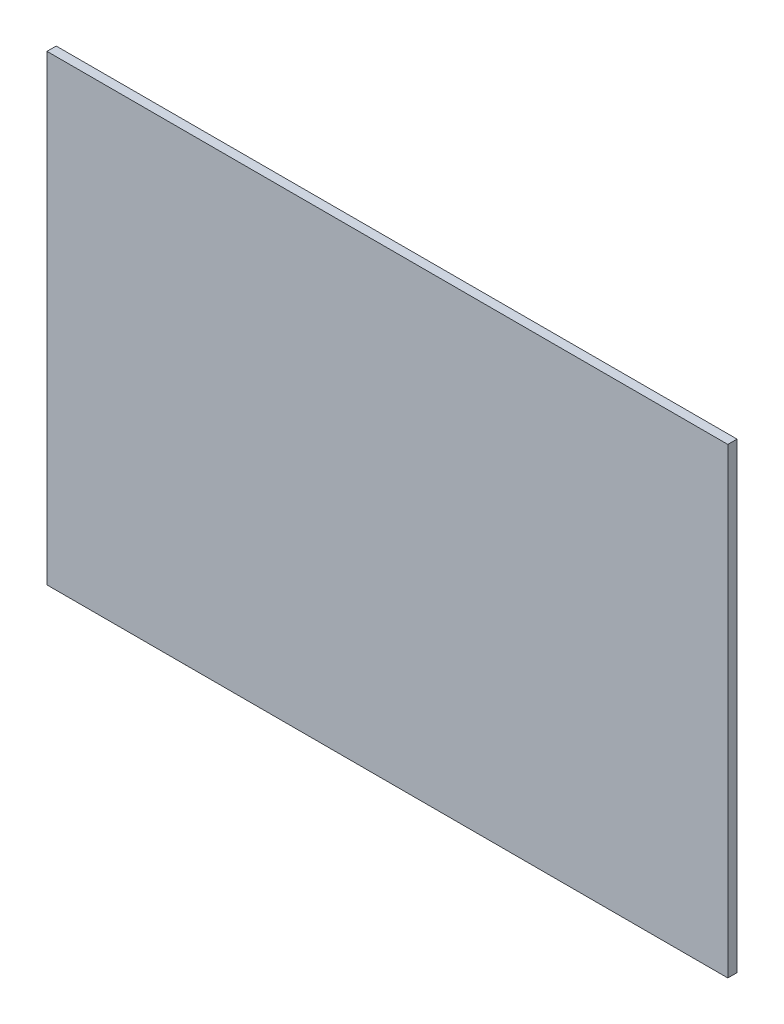
ISO-10303-21;
HEADER;
FILE_DESCRIPTION(('STEP AP214'),'2;1');
FILE_NAME('part.step','',(''),(''),'','','');
FILE_SCHEMA(('AUTOMOTIVE_DESIGN { 1 0 10303 214 1 1 1 1 }'));
ENDSEC;
DATA;
#1=APPLICATION_CONTEXT('core data for automotive mechanical design processes');
#2=APPLICATION_PROTOCOL_DEFINITION('international standard','automotive_design',2000,#1);
#3=PRODUCT_CONTEXT('',#1,'mechanical');
#4=PRODUCT('Part','Part','',(#3));
#5=PRODUCT_RELATED_PRODUCT_CATEGORY('part','',(#4));
#6=PRODUCT_DEFINITION_FORMATION('','',#4);
#7=PRODUCT_DEFINITION_CONTEXT('part definition',#1,'design');
#8=PRODUCT_DEFINITION('design','',#6,#7);
#9=PRODUCT_DEFINITION_SHAPE('','',#8);
#10=(LENGTH_UNIT() NAMED_UNIT(*) SI_UNIT(.MILLI.,.METRE.));
#11=(NAMED_UNIT(*) PLANE_ANGLE_UNIT() SI_UNIT($,.RADIAN.));
#12=(NAMED_UNIT(*) SI_UNIT($,.STERADIAN.) SOLID_ANGLE_UNIT());
#13=UNCERTAINTY_MEASURE_WITH_UNIT(LENGTH_MEASURE(1.E-05),#10,'distance_accuracy_value','');
#14=(GEOMETRIC_REPRESENTATION_CONTEXT(3) GLOBAL_UNCERTAINTY_ASSIGNED_CONTEXT((#13)) GLOBAL_UNIT_ASSIGNED_CONTEXT((#10,
#11,#12)) REPRESENTATION_CONTEXT('',''));
#15=CARTESIAN_POINT('',(0.,0.,0.));
#16=DIRECTION('',(0.,0.,1.));
#17=DIRECTION('',(1.,0.,0.));
#18=AXIS2_PLACEMENT_3D('',#15,#16,#17);
#19=CARTESIAN_POINT('',(0.,0.,1.51892));
#20=DIRECTION('',(1.,0.,0.));
#21=DIRECTION('',(0.,0.,-1.));
#22=AXIS2_PLACEMENT_3D('',#19,#20,#21);
#23=PLANE('',#22);
#24=DIRECTION('',(0.,-1.,0.));
#25=VECTOR('',#24,1.);
#26=CARTESIAN_POINT('',(0.,0.,0.));
#27=LINE('',#26,#25);
#28=CARTESIAN_POINT('',(0.,76.2,0.));
#29=VERTEX_POINT('',#28);
#30=CARTESIAN_POINT('',(0.,0.,0.));
#31=VERTEX_POINT('',#30);
#32=EDGE_CURVE('E107',#29,#31,#27,.T.);
#33=ORIENTED_EDGE('',*,*,#32,.T.);
#34=DIRECTION('',(0.,0.,-1.));
#35=VECTOR('',#34,1.);
#36=CARTESIAN_POINT('',(0.,0.,1.51892));
#37=LINE('',#36,#35);
#38=CARTESIAN_POINT('',(0.,0.,1.51892));
#39=VERTEX_POINT('',#38);
#40=EDGE_CURVE('E11',#39,#31,#37,.T.);
#41=ORIENTED_EDGE('',*,*,#40,.F.);
#42=DIRECTION('',(0.,-1.,0.));
#43=VECTOR('',#42,1.);
#44=CARTESIAN_POINT('',(0.,0.,1.51892));
#45=LINE('',#44,#43);
#46=CARTESIAN_POINT('',(0.,76.2,1.51892));
#47=VERTEX_POINT('',#46);
#48=EDGE_CURVE('E91',#47,#39,#45,.T.);
#49=ORIENTED_EDGE('',*,*,#48,.F.);
#50=DIRECTION('',(0.,0.,-1.));
#51=VECTOR('',#50,1.);
#52=CARTESIAN_POINT('',(0.,76.2,1.51892));
#53=LINE('',#52,#51);
#54=EDGE_CURVE('E103',#47,#29,#53,.T.);
#55=ORIENTED_EDGE('',*,*,#54,.T.);
#56=EDGE_LOOP('',(#33,#41,#49,#55));
#57=FACE_BOUND('',#56,.T.);
#58=ADVANCED_FACE('F39',(#57),#23,.F.);
#59=CARTESIAN_POINT('',(0.,0.,1.51892));
#60=DIRECTION('',(0.,1.,0.));
#61=DIRECTION('',(0.,0.,1.));
#62=AXIS2_PLACEMENT_3D('',#59,#60,#61);
#63=PLANE('',#62);
#64=DIRECTION('',(1.,0.,0.));
#65=VECTOR('',#64,1.);
#66=CARTESIAN_POINT('',(0.,0.,0.));
#67=LINE('',#66,#65);
#68=CARTESIAN_POINT('',(112.268,0.,0.));
#69=VERTEX_POINT('',#68);
#70=EDGE_CURVE('E96',#31,#69,#67,.T.);
#71=ORIENTED_EDGE('',*,*,#70,.T.);
#72=DIRECTION('',(0.,0.,-1.));
#73=VECTOR('',#72,1.);
#74=CARTESIAN_POINT('',(112.268,0.,1.51892));
#75=LINE('',#74,#73);
#76=CARTESIAN_POINT('',(112.268,0.,1.51892));
#77=VERTEX_POINT('',#76);
#78=EDGE_CURVE('E48',#77,#69,#75,.T.);
#79=ORIENTED_EDGE('',*,*,#78,.F.);
#80=DIRECTION('',(1.,0.,0.));
#81=VECTOR('',#80,1.);
#82=CARTESIAN_POINT('',(0.,0.,1.51892));
#83=LINE('',#82,#81);
#84=EDGE_CURVE('E86',#39,#77,#83,.T.);
#85=ORIENTED_EDGE('',*,*,#84,.F.);
#86=ORIENTED_EDGE('',*,*,#40,.T.);
#87=EDGE_LOOP('',(#71,#79,#85,#86));
#88=FACE_BOUND('',#87,.T.);
#89=ADVANCED_FACE('F95',(#88),#63,.F.);
#90=CARTESIAN_POINT('',(112.268,0.,1.51892));
#91=DIRECTION('',(-1.,0.,0.));
#92=DIRECTION('',(0.,0.,1.));
#93=AXIS2_PLACEMENT_3D('',#90,#91,#92);
#94=PLANE('',#93);
#95=DIRECTION('',(0.,1.,0.));
#96=VECTOR('',#95,1.);
#97=CARTESIAN_POINT('',(112.268,0.,0.));
#98=LINE('',#97,#96);
#99=CARTESIAN_POINT('',(112.268,76.2,0.));
#100=VERTEX_POINT('',#99);
#101=EDGE_CURVE('E73',#69,#100,#98,.T.);
#102=ORIENTED_EDGE('',*,*,#101,.T.);
#103=DIRECTION('',(0.,0.,-1.));
#104=VECTOR('',#103,1.);
#105=CARTESIAN_POINT('',(112.268,76.2,1.51892));
#106=LINE('',#105,#104);
#107=CARTESIAN_POINT('',(112.268,76.2,1.51892));
#108=VERTEX_POINT('',#107);
#109=EDGE_CURVE('E98',#108,#100,#106,.T.);
#110=ORIENTED_EDGE('',*,*,#109,.F.);
#111=DIRECTION('',(0.,1.,0.));
#112=VECTOR('',#111,1.);
#113=CARTESIAN_POINT('',(112.268,0.,1.51892));
#114=LINE('',#113,#112);
#115=EDGE_CURVE('E89',#77,#108,#114,.T.);
#116=ORIENTED_EDGE('',*,*,#115,.F.);
#117=ORIENTED_EDGE('',*,*,#78,.T.);
#118=EDGE_LOOP('',(#102,#110,#116,#117));
#119=FACE_BOUND('',#118,.T.);
#120=ADVANCED_FACE('F99',(#119),#94,.F.);
#121=CARTESIAN_POINT('',(0.,76.2,1.51892));
#122=DIRECTION('',(0.,-1.,0.));
#123=DIRECTION('',(0.,0.,-1.));
#124=AXIS2_PLACEMENT_3D('',#121,#122,#123);
#125=PLANE('',#124);
#126=DIRECTION('',(-1.,0.,0.));
#127=VECTOR('',#126,1.);
#128=CARTESIAN_POINT('',(0.,76.2,0.));
#129=LINE('',#128,#127);
#130=EDGE_CURVE('E79',#100,#29,#129,.T.);
#131=ORIENTED_EDGE('',*,*,#130,.T.);
#132=ORIENTED_EDGE('',*,*,#54,.F.);
#133=DIRECTION('',(-1.,0.,0.));
#134=VECTOR('',#133,1.);
#135=CARTESIAN_POINT('',(0.,76.2,1.51892));
#136=LINE('',#135,#134);
#137=EDGE_CURVE('E56',#108,#47,#136,.T.);
#138=ORIENTED_EDGE('',*,*,#137,.F.);
#139=ORIENTED_EDGE('',*,*,#109,.T.);
#140=EDGE_LOOP('',(#131,#132,#138,#139));
#141=FACE_BOUND('',#140,.T.);
#142=ADVANCED_FACE('F120',(#141),#125,.F.);
#143=CARTESIAN_POINT('',(0.,0.,1.51892));
#144=DIRECTION('',(0.,0.,-1.));
#145=DIRECTION('',(-1.,0.,0.));
#146=AXIS2_PLACEMENT_3D('',#143,#144,#145);
#147=PLANE('',#146);
#148=ORIENTED_EDGE('',*,*,#48,.T.);
#149=ORIENTED_EDGE('',*,*,#84,.T.);
#150=ORIENTED_EDGE('',*,*,#115,.T.);
#151=ORIENTED_EDGE('',*,*,#137,.T.);
#152=EDGE_LOOP('',(#148,#149,#150,#151));
#153=FACE_BOUND('',#152,.T.);
#154=ADVANCED_FACE('F87',(#153),#147,.F.);
#155=CARTESIAN_POINT('',(0.,0.,0.));
#156=DIRECTION('',(0.,0.,-1.));
#157=DIRECTION('',(-1.,0.,0.));
#158=AXIS2_PLACEMENT_3D('',#155,#156,#157);
#159=PLANE('',#158);
#160=ORIENTED_EDGE('',*,*,#32,.F.);
#161=ORIENTED_EDGE('',*,*,#130,.F.);
#162=ORIENTED_EDGE('',*,*,#101,.F.);
#163=ORIENTED_EDGE('',*,*,#70,.F.);
#164=EDGE_LOOP('',(#160,#161,#162,#163));
#165=FACE_BOUND('',#164,.T.);
#166=ADVANCED_FACE('F123',(#165),#159,.T.);
#167=CLOSED_SHELL('',(#58,#89,#120,#142,#154,#166));
#168=MANIFOLD_SOLID_BREP('B2',#167);
#169=ADVANCED_BREP_SHAPE_REPRESENTATION('',(#18,#168),#14);
#170=SHAPE_DEFINITION_REPRESENTATION(#9,#169);
ENDSEC;
END-ISO-10303-21;
